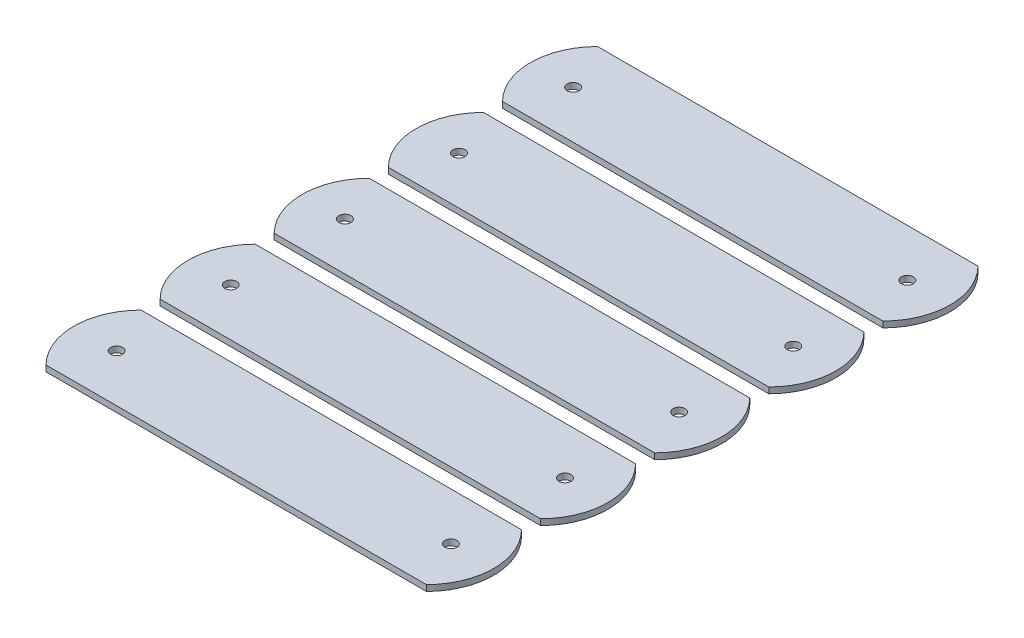
ISO-10303-21;
HEADER;
FILE_DESCRIPTION(('STEP AP214'),'2;1');
FILE_NAME('part.step','',(''),(''),'','','');
FILE_SCHEMA(('AUTOMOTIVE_DESIGN { 1 0 10303 214 1 1 1 1 }'));
ENDSEC;
DATA;
#1=APPLICATION_CONTEXT('core data for automotive mechanical design processes');
#2=APPLICATION_PROTOCOL_DEFINITION('international standard','automotive_design',2000,#1);
#3=PRODUCT_CONTEXT('',#1,'mechanical');
#4=PRODUCT('Part','Part','',(#3));
#5=PRODUCT_RELATED_PRODUCT_CATEGORY('part','',(#4));
#6=PRODUCT_DEFINITION_FORMATION('','',#4);
#7=PRODUCT_DEFINITION_CONTEXT('part definition',#1,'design');
#8=PRODUCT_DEFINITION('design','',#6,#7);
#9=PRODUCT_DEFINITION_SHAPE('','',#8);
#10=(LENGTH_UNIT() NAMED_UNIT(*) SI_UNIT(.MILLI.,.METRE.));
#11=(NAMED_UNIT(*) PLANE_ANGLE_UNIT() SI_UNIT($,.RADIAN.));
#12=(NAMED_UNIT(*) SI_UNIT($,.STERADIAN.) SOLID_ANGLE_UNIT());
#13=UNCERTAINTY_MEASURE_WITH_UNIT(LENGTH_MEASURE(1.E-05),#10,'distance_accuracy_value','');
#14=(GEOMETRIC_REPRESENTATION_CONTEXT(3) GLOBAL_UNCERTAINTY_ASSIGNED_CONTEXT((#13)) GLOBAL_UNIT_ASSIGNED_CONTEXT((#10,
#11,#12)) REPRESENTATION_CONTEXT('',''));
#15=CARTESIAN_POINT('',(0.,0.,0.));
#16=DIRECTION('',(0.,0.,1.));
#17=DIRECTION('',(1.,0.,0.));
#18=AXIS2_PLACEMENT_3D('',#15,#16,#17);
#19=CARTESIAN_POINT('',(0.,0.79375,-109.22));
#20=DIRECTION('',(0.,0.,-1.));
#21=DIRECTION('',(-1.,0.,0.));
#22=AXIS2_PLACEMENT_3D('',#19,#20,#21);
#23=PLANE('',#22);
#24=DIRECTION('',(1.,0.,0.));
#25=VECTOR('',#24,1.);
#26=CARTESIAN_POINT('',(0.,-0.79375,-109.22));
#27=LINE('',#26,#25);
#28=CARTESIAN_POINT('',(-50.8,-0.79375,-109.22));
#29=VERTEX_POINT('',#28);
#30=CARTESIAN_POINT('',(50.8,-0.79375,-109.22));
#31=VERTEX_POINT('',#30);
#32=EDGE_CURVE('E114',#29,#31,#27,.T.);
#33=ORIENTED_EDGE('',*,*,#32,.T.);
#34=DIRECTION('',(0.,-1.,0.));
#35=VECTOR('',#34,1.);
#36=CARTESIAN_POINT('',(50.8,0.79375,-109.22));
#37=LINE('',#36,#35);
#38=CARTESIAN_POINT('',(50.8,0.79375,-109.22));
#39=VERTEX_POINT('',#38);
#40=EDGE_CURVE('E12',#39,#31,#37,.T.);
#41=ORIENTED_EDGE('',*,*,#40,.F.);
#42=DIRECTION('',(1.,0.,0.));
#43=VECTOR('',#42,1.);
#44=CARTESIAN_POINT('',(0.,0.79375,-109.22));
#45=LINE('',#44,#43);
#46=CARTESIAN_POINT('',(-50.8,0.79375,-109.22));
#47=VERTEX_POINT('',#46);
#48=EDGE_CURVE('E84',#47,#39,#45,.T.);
#49=ORIENTED_EDGE('',*,*,#48,.F.);
#50=DIRECTION('',(0.,-1.,0.));
#51=VECTOR('',#50,1.);
#52=CARTESIAN_POINT('',(-50.8,0.79375,-109.22));
#53=LINE('',#52,#51);
#54=EDGE_CURVE('E60',#47,#29,#53,.T.);
#55=ORIENTED_EDGE('',*,*,#54,.T.);
#56=EDGE_LOOP('',(#33,#41,#49,#55));
#57=FACE_BOUND('',#56,.T.);
#58=ADVANCED_FACE('F44',(#57),#23,.F.);
#59=CARTESIAN_POINT('',(38.1,0.79375,-121.92));
#60=DIRECTION('',(0.,-1.,0.));
#61=DIRECTION('',(0.,0.,-1.));
#62=AXIS2_PLACEMENT_3D('',#59,#60,#61);
#63=CYLINDRICAL_SURFACE('',#62,17.9605122421383);
#64=CARTESIAN_POINT('',(38.1,-0.79375,-121.92));
#65=DIRECTION('',(0.,1.,0.));
#66=DIRECTION('',(0.,0.,1.));
#67=AXIS2_PLACEMENT_3D('',#64,#65,#66);
#68=CIRCLE('',#67,17.9605122421383);
#69=CARTESIAN_POINT('',(50.8,-0.79375,-134.62));
#70=VERTEX_POINT('',#69);
#71=EDGE_CURVE('E93',#70,#31,#68,.F.);
#72=ORIENTED_EDGE('',*,*,#71,.F.);
#73=DIRECTION('',(0.,-1.,0.));
#74=VECTOR('',#73,1.);
#75=CARTESIAN_POINT('',(50.8,0.79375,-134.62));
#76=LINE('',#75,#74);
#77=CARTESIAN_POINT('',(50.8,0.79375,-134.62));
#78=VERTEX_POINT('',#77);
#79=EDGE_CURVE('E52',#78,#70,#76,.T.);
#80=ORIENTED_EDGE('',*,*,#79,.F.);
#81=CARTESIAN_POINT('',(38.1,0.79375,-121.92));
#82=DIRECTION('',(0.,1.,0.));
#83=DIRECTION('',(0.,0.,1.));
#84=AXIS2_PLACEMENT_3D('',#81,#82,#83);
#85=CIRCLE('',#84,17.9605122421383);
#86=EDGE_CURVE('E91',#78,#39,#85,.F.);
#87=ORIENTED_EDGE('',*,*,#86,.T.);
#88=ORIENTED_EDGE('',*,*,#40,.T.);
#89=EDGE_LOOP('',(#72,#80,#87,#88));
#90=FACE_BOUND('',#89,.T.);
#91=ADVANCED_FACE('F90',(#90),#63,.T.);
#92=CARTESIAN_POINT('',(0.,0.79375,-134.62));
#93=DIRECTION('',(0.,0.,-1.));
#94=DIRECTION('',(-1.,0.,0.));
#95=AXIS2_PLACEMENT_3D('',#92,#93,#94);
#96=PLANE('',#95);
#97=DIRECTION('',(1.,0.,0.));
#98=VECTOR('',#97,1.);
#99=CARTESIAN_POINT('',(0.,-0.79375,-134.62));
#100=LINE('',#99,#98);
#101=CARTESIAN_POINT('',(-50.8,-0.79375,-134.62));
#102=VERTEX_POINT('',#101);
#103=EDGE_CURVE('E117',#102,#70,#100,.T.);
#104=ORIENTED_EDGE('',*,*,#103,.F.);
#105=DIRECTION('',(0.,-1.,0.));
#106=VECTOR('',#105,1.);
#107=CARTESIAN_POINT('',(-50.8,0.79375,-134.62));
#108=LINE('',#107,#106);
#109=CARTESIAN_POINT('',(-50.8,0.79375,-134.62));
#110=VERTEX_POINT('',#109);
#111=EDGE_CURVE('E73',#110,#102,#108,.T.);
#112=ORIENTED_EDGE('',*,*,#111,.F.);
#113=DIRECTION('',(1.,0.,0.));
#114=VECTOR('',#113,1.);
#115=CARTESIAN_POINT('',(0.,0.79375,-134.62));
#116=LINE('',#115,#114);
#117=EDGE_CURVE('E100',#110,#78,#116,.T.);
#118=ORIENTED_EDGE('',*,*,#117,.T.);
#119=ORIENTED_EDGE('',*,*,#79,.T.);
#120=EDGE_LOOP('',(#104,#112,#118,#119));
#121=FACE_BOUND('',#120,.T.);
#122=ADVANCED_FACE('F102',(#121),#96,.T.);
#123=CARTESIAN_POINT('',(-44.637105685512,0.79375,-121.92));
#124=DIRECTION('',(0.,-1.,0.));
#125=DIRECTION('',(0.,0.,-1.));
#126=AXIS2_PLACEMENT_3D('',#123,#124,#125);
#127=CYLINDRICAL_SURFACE('',#126,1.6002);
#128=CARTESIAN_POINT('',(-44.637105685512,0.79375,-121.92));
#129=DIRECTION('',(0.,1.,0.));
#130=DIRECTION('',(0.,0.,1.));
#131=AXIS2_PLACEMENT_3D('',#128,#129,#130);
#132=CIRCLE('',#131,1.6002);
#133=CARTESIAN_POINT('',(-44.637105685512,0.79375,-120.3198));
#134=VERTEX_POINT('',#133);
#135=EDGE_CURVE('E105',#134,#134,#132,.T.);
#136=ORIENTED_EDGE('',*,*,#135,.T.);
#137=EDGE_LOOP('',(#136));
#138=FACE_BOUND('',#137,.T.);
#139=CARTESIAN_POINT('',(-44.637105685512,-0.79375,-121.92));
#140=DIRECTION('',(0.,1.,0.));
#141=DIRECTION('',(0.,0.,1.));
#142=AXIS2_PLACEMENT_3D('',#139,#140,#141);
#143=CIRCLE('',#142,1.6002);
#144=CARTESIAN_POINT('',(-44.637105685512,-0.79375,-120.3198));
#145=VERTEX_POINT('',#144);
#146=EDGE_CURVE('E122',#145,#145,#143,.T.);
#147=ORIENTED_EDGE('',*,*,#146,.F.);
#148=EDGE_LOOP('',(#147));
#149=FACE_BOUND('',#148,.T.);
#150=ADVANCED_FACE('F149',(#138,#149),#127,.F.);
#151=CARTESIAN_POINT('',(-38.1,0.79375,-121.92));
#152=DIRECTION('',(0.,-1.,0.));
#153=DIRECTION('',(0.,0.,-1.));
#154=AXIS2_PLACEMENT_3D('',#151,#152,#153);
#155=CYLINDRICAL_SURFACE('',#154,17.9605122421383);
#156=CARTESIAN_POINT('',(-38.1,-0.79375,-121.92));
#157=DIRECTION('',(0.,1.,0.));
#158=DIRECTION('',(0.,0.,1.));
#159=AXIS2_PLACEMENT_3D('',#156,#157,#158);
#160=CIRCLE('',#159,17.9605122421383);
#161=EDGE_CURVE('E119',#29,#102,#160,.F.);
#162=ORIENTED_EDGE('',*,*,#161,.F.);
#163=ORIENTED_EDGE('',*,*,#54,.F.);
#164=CARTESIAN_POINT('',(-38.1,0.79375,-121.92));
#165=DIRECTION('',(0.,1.,0.));
#166=DIRECTION('',(0.,0.,1.));
#167=AXIS2_PLACEMENT_3D('',#164,#165,#166);
#168=CIRCLE('',#167,17.9605122421383);
#169=EDGE_CURVE('E103',#47,#110,#168,.F.);
#170=ORIENTED_EDGE('',*,*,#169,.T.);
#171=ORIENTED_EDGE('',*,*,#111,.T.);
#172=EDGE_LOOP('',(#162,#163,#170,#171));
#173=FACE_BOUND('',#172,.T.);
#174=ADVANCED_FACE('F147',(#173),#155,.T.);
#175=CARTESIAN_POINT('',(44.6371056855121,0.79375,-121.92));
#176=DIRECTION('',(0.,-1.,0.));
#177=DIRECTION('',(0.,0.,-1.));
#178=AXIS2_PLACEMENT_3D('',#175,#176,#177);
#179=CYLINDRICAL_SURFACE('',#178,1.6002);
#180=CARTESIAN_POINT('',(44.6371056855121,0.79375,-121.92));
#181=DIRECTION('',(0.,1.,0.));
#182=DIRECTION('',(0.,0.,1.));
#183=AXIS2_PLACEMENT_3D('',#180,#181,#182);
#184=CIRCLE('',#183,1.6002);
#185=CARTESIAN_POINT('',(44.6371056855121,0.79375,-120.3198));
#186=VERTEX_POINT('',#185);
#187=EDGE_CURVE('E111',#186,#186,#184,.F.);
#188=ORIENTED_EDGE('',*,*,#187,.F.);
#189=EDGE_LOOP('',(#188));
#190=FACE_BOUND('',#189,.T.);
#191=CARTESIAN_POINT('',(44.6371056855121,-0.79375,-121.92));
#192=DIRECTION('',(0.,1.,0.));
#193=DIRECTION('',(0.,0.,1.));
#194=AXIS2_PLACEMENT_3D('',#191,#192,#193);
#195=CIRCLE('',#194,1.6002);
#196=CARTESIAN_POINT('',(44.6371056855121,-0.79375,-120.3198));
#197=VERTEX_POINT('',#196);
#198=EDGE_CURVE('E125',#197,#197,#195,.F.);
#199=ORIENTED_EDGE('',*,*,#198,.T.);
#200=EDGE_LOOP('',(#199));
#201=FACE_BOUND('',#200,.T.);
#202=ADVANCED_FACE('F131',(#190,#201),#179,.F.);
#203=CARTESIAN_POINT('',(0.,0.79375,-121.92));
#204=DIRECTION('',(0.,1.,0.));
#205=DIRECTION('',(0.,0.,1.));
#206=AXIS2_PLACEMENT_3D('',#203,#204,#205);
#207=PLANE('',#206);
#208=ORIENTED_EDGE('',*,*,#48,.T.);
#209=ORIENTED_EDGE('',*,*,#86,.F.);
#210=ORIENTED_EDGE('',*,*,#117,.F.);
#211=ORIENTED_EDGE('',*,*,#169,.F.);
#212=EDGE_LOOP('',(#208,#209,#210,#211));
#213=FACE_BOUND('',#212,.T.);
#214=ORIENTED_EDGE('',*,*,#135,.F.);
#215=EDGE_LOOP('',(#214));
#216=FACE_BOUND('',#215,.T.);
#217=ORIENTED_EDGE('',*,*,#187,.T.);
#218=EDGE_LOOP('',(#217));
#219=FACE_BOUND('',#218,.T.);
#220=ADVANCED_FACE('F98',(#213,#216,#219),#207,.T.);
#221=CARTESIAN_POINT('',(0.,-0.79375,-121.92));
#222=DIRECTION('',(0.,1.,0.));
#223=DIRECTION('',(0.,0.,1.));
#224=AXIS2_PLACEMENT_3D('',#221,#222,#223);
#225=PLANE('',#224);
#226=ORIENTED_EDGE('',*,*,#32,.F.);
#227=ORIENTED_EDGE('',*,*,#161,.T.);
#228=ORIENTED_EDGE('',*,*,#103,.T.);
#229=ORIENTED_EDGE('',*,*,#71,.T.);
#230=EDGE_LOOP('',(#226,#227,#228,#229));
#231=FACE_BOUND('',#230,.T.);
#232=ORIENTED_EDGE('',*,*,#146,.T.);
#233=EDGE_LOOP('',(#232));
#234=FACE_BOUND('',#233,.T.);
#235=ORIENTED_EDGE('',*,*,#198,.F.);
#236=EDGE_LOOP('',(#235));
#237=FACE_BOUND('',#236,.T.);
#238=ADVANCED_FACE('F133',(#231,#234,#237),#225,.F.);
#239=CLOSED_SHELL('',(#58,#91,#122,#150,#174,#202,#220,#238));
#240=MANIFOLD_SOLID_BREP('B2',#239);
#241=CARTESIAN_POINT('',(0.,0.79375,-78.74));
#242=DIRECTION('',(0.,0.,-1.));
#243=DIRECTION('',(-1.,0.,0.));
#244=AXIS2_PLACEMENT_3D('',#241,#242,#243);
#245=PLANE('',#244);
#246=DIRECTION('',(1.,0.,0.));
#247=VECTOR('',#246,1.);
#248=CARTESIAN_POINT('',(0.,-0.79375,-78.74));
#249=LINE('',#248,#247);
#250=CARTESIAN_POINT('',(-50.8,-0.79375,-78.74));
#251=VERTEX_POINT('',#250);
#252=CARTESIAN_POINT('',(50.8,-0.79375,-78.74));
#253=VERTEX_POINT('',#252);
#254=EDGE_CURVE('E302',#251,#253,#249,.T.);
#255=ORIENTED_EDGE('',*,*,#254,.T.);
#256=DIRECTION('',(0.,-1.,0.));
#257=VECTOR('',#256,1.);
#258=CARTESIAN_POINT('',(50.8,0.79375,-78.74));
#259=LINE('',#258,#257);
#260=CARTESIAN_POINT('',(50.8,0.79375,-78.74));
#261=VERTEX_POINT('',#260);
#262=EDGE_CURVE('E42',#261,#253,#259,.T.);
#263=ORIENTED_EDGE('',*,*,#262,.F.);
#264=DIRECTION('',(1.,0.,0.));
#265=VECTOR('',#264,1.);
#266=CARTESIAN_POINT('',(0.,0.79375,-78.74));
#267=LINE('',#266,#265);
#268=CARTESIAN_POINT('',(-50.8,0.79375,-78.74));
#269=VERTEX_POINT('',#268);
#270=EDGE_CURVE('E272',#269,#261,#267,.T.);
#271=ORIENTED_EDGE('',*,*,#270,.F.);
#272=DIRECTION('',(0.,-1.,0.));
#273=VECTOR('',#272,1.);
#274=CARTESIAN_POINT('',(-50.8,0.79375,-78.74));
#275=LINE('',#274,#273);
#276=EDGE_CURVE('E248',#269,#251,#275,.T.);
#277=ORIENTED_EDGE('',*,*,#276,.T.);
#278=EDGE_LOOP('',(#255,#263,#271,#277));
#279=FACE_BOUND('',#278,.T.);
#280=ADVANCED_FACE('F232',(#279),#245,.F.);
#281=CARTESIAN_POINT('',(38.1,0.79375,-91.44));
#282=DIRECTION('',(0.,-1.,0.));
#283=DIRECTION('',(0.,0.,-1.));
#284=AXIS2_PLACEMENT_3D('',#281,#282,#283);
#285=CYLINDRICAL_SURFACE('',#284,17.9605122421383);
#286=CARTESIAN_POINT('',(38.1,-0.79375,-91.44));
#287=DIRECTION('',(0.,1.,0.));
#288=DIRECTION('',(0.,0.,1.));
#289=AXIS2_PLACEMENT_3D('',#286,#287,#288);
#290=CIRCLE('',#289,17.9605122421383);
#291=CARTESIAN_POINT('',(50.8,-0.79375,-104.14));
#292=VERTEX_POINT('',#291);
#293=EDGE_CURVE('E281',#292,#253,#290,.F.);
#294=ORIENTED_EDGE('',*,*,#293,.F.);
#295=DIRECTION('',(0.,-1.,0.));
#296=VECTOR('',#295,1.);
#297=CARTESIAN_POINT('',(50.8,0.79375,-104.14));
#298=LINE('',#297,#296);
#299=CARTESIAN_POINT('',(50.8,0.79375,-104.14));
#300=VERTEX_POINT('',#299);
#301=EDGE_CURVE('E240',#300,#292,#298,.T.);
#302=ORIENTED_EDGE('',*,*,#301,.F.);
#303=CARTESIAN_POINT('',(38.1,0.79375,-91.44));
#304=DIRECTION('',(0.,1.,0.));
#305=DIRECTION('',(0.,0.,1.));
#306=AXIS2_PLACEMENT_3D('',#303,#304,#305);
#307=CIRCLE('',#306,17.9605122421383);
#308=EDGE_CURVE('E279',#300,#261,#307,.F.);
#309=ORIENTED_EDGE('',*,*,#308,.T.);
#310=ORIENTED_EDGE('',*,*,#262,.T.);
#311=EDGE_LOOP('',(#294,#302,#309,#310));
#312=FACE_BOUND('',#311,.T.);
#313=ADVANCED_FACE('F278',(#312),#285,.T.);
#314=CARTESIAN_POINT('',(0.,0.79375,-104.14));
#315=DIRECTION('',(0.,0.,-1.));
#316=DIRECTION('',(-1.,0.,0.));
#317=AXIS2_PLACEMENT_3D('',#314,#315,#316);
#318=PLANE('',#317);
#319=DIRECTION('',(1.,0.,0.));
#320=VECTOR('',#319,1.);
#321=CARTESIAN_POINT('',(0.,-0.79375,-104.14));
#322=LINE('',#321,#320);
#323=CARTESIAN_POINT('',(-50.8,-0.79375,-104.14));
#324=VERTEX_POINT('',#323);
#325=EDGE_CURVE('E305',#324,#292,#322,.T.);
#326=ORIENTED_EDGE('',*,*,#325,.F.);
#327=DIRECTION('',(0.,-1.,0.));
#328=VECTOR('',#327,1.);
#329=CARTESIAN_POINT('',(-50.8,0.79375,-104.14));
#330=LINE('',#329,#328);
#331=CARTESIAN_POINT('',(-50.8,0.79375,-104.14));
#332=VERTEX_POINT('',#331);
#333=EDGE_CURVE('E261',#332,#324,#330,.T.);
#334=ORIENTED_EDGE('',*,*,#333,.F.);
#335=DIRECTION('',(1.,0.,0.));
#336=VECTOR('',#335,1.);
#337=CARTESIAN_POINT('',(0.,0.79375,-104.14));
#338=LINE('',#337,#336);
#339=EDGE_CURVE('E288',#332,#300,#338,.T.);
#340=ORIENTED_EDGE('',*,*,#339,.T.);
#341=ORIENTED_EDGE('',*,*,#301,.T.);
#342=EDGE_LOOP('',(#326,#334,#340,#341));
#343=FACE_BOUND('',#342,.T.);
#344=ADVANCED_FACE('F290',(#343),#318,.T.);
#345=CARTESIAN_POINT('',(-44.637105685512,0.79375,-91.44));
#346=DIRECTION('',(0.,-1.,0.));
#347=DIRECTION('',(0.,0.,-1.));
#348=AXIS2_PLACEMENT_3D('',#345,#346,#347);
#349=CYLINDRICAL_SURFACE('',#348,1.6002);
#350=CARTESIAN_POINT('',(-44.637105685512,0.79375,-91.44));
#351=DIRECTION('',(0.,1.,0.));
#352=DIRECTION('',(0.,0.,1.));
#353=AXIS2_PLACEMENT_3D('',#350,#351,#352);
#354=CIRCLE('',#353,1.6002);
#355=CARTESIAN_POINT('',(-44.637105685512,0.79375,-89.8398));
#356=VERTEX_POINT('',#355);
#357=EDGE_CURVE('E293',#356,#356,#354,.T.);
#358=ORIENTED_EDGE('',*,*,#357,.T.);
#359=EDGE_LOOP('',(#358));
#360=FACE_BOUND('',#359,.T.);
#361=CARTESIAN_POINT('',(-44.637105685512,-0.79375,-91.44));
#362=DIRECTION('',(0.,1.,0.));
#363=DIRECTION('',(0.,0.,1.));
#364=AXIS2_PLACEMENT_3D('',#361,#362,#363);
#365=CIRCLE('',#364,1.6002);
#366=CARTESIAN_POINT('',(-44.637105685512,-0.79375,-89.8398));
#367=VERTEX_POINT('',#366);
#368=EDGE_CURVE('E310',#367,#367,#365,.T.);
#369=ORIENTED_EDGE('',*,*,#368,.F.);
#370=EDGE_LOOP('',(#369));
#371=FACE_BOUND('',#370,.T.);
#372=ADVANCED_FACE('F337',(#360,#371),#349,.F.);
#373=CARTESIAN_POINT('',(-38.1,0.79375,-91.44));
#374=DIRECTION('',(0.,-1.,0.));
#375=DIRECTION('',(0.,0.,-1.));
#376=AXIS2_PLACEMENT_3D('',#373,#374,#375);
#377=CYLINDRICAL_SURFACE('',#376,17.9605122421383);
#378=CARTESIAN_POINT('',(-38.1,-0.79375,-91.44));
#379=DIRECTION('',(0.,1.,0.));
#380=DIRECTION('',(0.,0.,1.));
#381=AXIS2_PLACEMENT_3D('',#378,#379,#380);
#382=CIRCLE('',#381,17.9605122421383);
#383=EDGE_CURVE('E307',#251,#324,#382,.F.);
#384=ORIENTED_EDGE('',*,*,#383,.F.);
#385=ORIENTED_EDGE('',*,*,#276,.F.);
#386=CARTESIAN_POINT('',(-38.1,0.79375,-91.44));
#387=DIRECTION('',(0.,1.,0.));
#388=DIRECTION('',(0.,0.,1.));
#389=AXIS2_PLACEMENT_3D('',#386,#387,#388);
#390=CIRCLE('',#389,17.9605122421383);
#391=EDGE_CURVE('E291',#269,#332,#390,.F.);
#392=ORIENTED_EDGE('',*,*,#391,.T.);
#393=ORIENTED_EDGE('',*,*,#333,.T.);
#394=EDGE_LOOP('',(#384,#385,#392,#393));
#395=FACE_BOUND('',#394,.T.);
#396=ADVANCED_FACE('F335',(#395),#377,.T.);
#397=CARTESIAN_POINT('',(44.6371056855121,0.79375,-91.44));
#398=DIRECTION('',(0.,-1.,0.));
#399=DIRECTION('',(0.,0.,-1.));
#400=AXIS2_PLACEMENT_3D('',#397,#398,#399);
#401=CYLINDRICAL_SURFACE('',#400,1.6002);
#402=CARTESIAN_POINT('',(44.6371056855121,0.79375,-91.44));
#403=DIRECTION('',(0.,1.,0.));
#404=DIRECTION('',(0.,0.,1.));
#405=AXIS2_PLACEMENT_3D('',#402,#403,#404);
#406=CIRCLE('',#405,1.6002);
#407=CARTESIAN_POINT('',(44.6371056855121,0.79375,-89.8398));
#408=VERTEX_POINT('',#407);
#409=EDGE_CURVE('E299',#408,#408,#406,.F.);
#410=ORIENTED_EDGE('',*,*,#409,.F.);
#411=EDGE_LOOP('',(#410));
#412=FACE_BOUND('',#411,.T.);
#413=CARTESIAN_POINT('',(44.6371056855121,-0.79375,-91.44));
#414=DIRECTION('',(0.,1.,0.));
#415=DIRECTION('',(0.,0.,1.));
#416=AXIS2_PLACEMENT_3D('',#413,#414,#415);
#417=CIRCLE('',#416,1.6002);
#418=CARTESIAN_POINT('',(44.6371056855121,-0.79375,-89.8398));
#419=VERTEX_POINT('',#418);
#420=EDGE_CURVE('E313',#419,#419,#417,.F.);
#421=ORIENTED_EDGE('',*,*,#420,.T.);
#422=EDGE_LOOP('',(#421));
#423=FACE_BOUND('',#422,.T.);
#424=ADVANCED_FACE('F319',(#412,#423),#401,.F.);
#425=CARTESIAN_POINT('',(0.,0.79375,-91.44));
#426=DIRECTION('',(0.,1.,0.));
#427=DIRECTION('',(0.,0.,1.));
#428=AXIS2_PLACEMENT_3D('',#425,#426,#427);
#429=PLANE('',#428);
#430=ORIENTED_EDGE('',*,*,#270,.T.);
#431=ORIENTED_EDGE('',*,*,#308,.F.);
#432=ORIENTED_EDGE('',*,*,#339,.F.);
#433=ORIENTED_EDGE('',*,*,#391,.F.);
#434=EDGE_LOOP('',(#430,#431,#432,#433));
#435=FACE_BOUND('',#434,.T.);
#436=ORIENTED_EDGE('',*,*,#357,.F.);
#437=EDGE_LOOP('',(#436));
#438=FACE_BOUND('',#437,.T.);
#439=ORIENTED_EDGE('',*,*,#409,.T.);
#440=EDGE_LOOP('',(#439));
#441=FACE_BOUND('',#440,.T.);
#442=ADVANCED_FACE('F286',(#435,#438,#441),#429,.T.);
#443=CARTESIAN_POINT('',(0.,-0.79375,-91.44));
#444=DIRECTION('',(0.,1.,0.));
#445=DIRECTION('',(0.,0.,1.));
#446=AXIS2_PLACEMENT_3D('',#443,#444,#445);
#447=PLANE('',#446);
#448=ORIENTED_EDGE('',*,*,#254,.F.);
#449=ORIENTED_EDGE('',*,*,#383,.T.);
#450=ORIENTED_EDGE('',*,*,#325,.T.);
#451=ORIENTED_EDGE('',*,*,#293,.T.);
#452=EDGE_LOOP('',(#448,#449,#450,#451));
#453=FACE_BOUND('',#452,.T.);
#454=ORIENTED_EDGE('',*,*,#368,.T.);
#455=EDGE_LOOP('',(#454));
#456=FACE_BOUND('',#455,.T.);
#457=ORIENTED_EDGE('',*,*,#420,.F.);
#458=EDGE_LOOP('',(#457));
#459=FACE_BOUND('',#458,.T.);
#460=ADVANCED_FACE('F321',(#453,#456,#459),#447,.F.);
#461=CLOSED_SHELL('',(#280,#313,#344,#372,#396,#424,#442,#460));
#462=MANIFOLD_SOLID_BREP('B6',#461);
#463=CARTESIAN_POINT('',(0.,0.79375,-48.26));
#464=DIRECTION('',(0.,0.,-1.));
#465=DIRECTION('',(-1.,0.,0.));
#466=AXIS2_PLACEMENT_3D('',#463,#464,#465);
#467=PLANE('',#466);
#468=DIRECTION('',(1.,0.,0.));
#469=VECTOR('',#468,1.);
#470=CARTESIAN_POINT('',(0.,-0.79375,-48.26));
#471=LINE('',#470,#469);
#472=CARTESIAN_POINT('',(-50.8,-0.79375,-48.26));
#473=VERTEX_POINT('',#472);
#474=CARTESIAN_POINT('',(50.8,-0.79375,-48.26));
#475=VERTEX_POINT('',#474);
#476=EDGE_CURVE('E490',#473,#475,#471,.T.);
#477=ORIENTED_EDGE('',*,*,#476,.T.);
#478=DIRECTION('',(0.,-1.,0.));
#479=VECTOR('',#478,1.);
#480=CARTESIAN_POINT('',(50.8,0.79375,-48.26));
#481=LINE('',#480,#479);
#482=CARTESIAN_POINT('',(50.8,0.79375,-48.26));
#483=VERTEX_POINT('',#482);
#484=EDGE_CURVE('E230',#483,#475,#481,.T.);
#485=ORIENTED_EDGE('',*,*,#484,.F.);
#486=DIRECTION('',(1.,0.,0.));
#487=VECTOR('',#486,1.);
#488=CARTESIAN_POINT('',(0.,0.79375,-48.26));
#489=LINE('',#488,#487);
#490=CARTESIAN_POINT('',(-50.8,0.79375,-48.26));
#491=VERTEX_POINT('',#490);
#492=EDGE_CURVE('E460',#491,#483,#489,.T.);
#493=ORIENTED_EDGE('',*,*,#492,.F.);
#494=DIRECTION('',(0.,-1.,0.));
#495=VECTOR('',#494,1.);
#496=CARTESIAN_POINT('',(-50.8,0.79375,-48.26));
#497=LINE('',#496,#495);
#498=EDGE_CURVE('E436',#491,#473,#497,.T.);
#499=ORIENTED_EDGE('',*,*,#498,.T.);
#500=EDGE_LOOP('',(#477,#485,#493,#499));
#501=FACE_BOUND('',#500,.T.);
#502=ADVANCED_FACE('F420',(#501),#467,.F.);
#503=CARTESIAN_POINT('',(38.1,0.79375,-60.96));
#504=DIRECTION('',(0.,-1.,0.));
#505=DIRECTION('',(0.,0.,-1.));
#506=AXIS2_PLACEMENT_3D('',#503,#504,#505);
#507=CYLINDRICAL_SURFACE('',#506,17.9605122421383);
#508=CARTESIAN_POINT('',(38.1,-0.79375,-60.96));
#509=DIRECTION('',(0.,1.,0.));
#510=DIRECTION('',(0.,0.,1.));
#511=AXIS2_PLACEMENT_3D('',#508,#509,#510);
#512=CIRCLE('',#511,17.9605122421383);
#513=CARTESIAN_POINT('',(50.8,-0.79375,-73.66));
#514=VERTEX_POINT('',#513);
#515=EDGE_CURVE('E469',#514,#475,#512,.F.);
#516=ORIENTED_EDGE('',*,*,#515,.F.);
#517=DIRECTION('',(0.,-1.,0.));
#518=VECTOR('',#517,1.);
#519=CARTESIAN_POINT('',(50.8,0.79375,-73.66));
#520=LINE('',#519,#518);
#521=CARTESIAN_POINT('',(50.8,0.79375,-73.66));
#522=VERTEX_POINT('',#521);
#523=EDGE_CURVE('E428',#522,#514,#520,.T.);
#524=ORIENTED_EDGE('',*,*,#523,.F.);
#525=CARTESIAN_POINT('',(38.1,0.79375,-60.96));
#526=DIRECTION('',(0.,1.,0.));
#527=DIRECTION('',(0.,0.,1.));
#528=AXIS2_PLACEMENT_3D('',#525,#526,#527);
#529=CIRCLE('',#528,17.9605122421383);
#530=EDGE_CURVE('E467',#522,#483,#529,.F.);
#531=ORIENTED_EDGE('',*,*,#530,.T.);
#532=ORIENTED_EDGE('',*,*,#484,.T.);
#533=EDGE_LOOP('',(#516,#524,#531,#532));
#534=FACE_BOUND('',#533,.T.);
#535=ADVANCED_FACE('F466',(#534),#507,.T.);
#536=CARTESIAN_POINT('',(0.,0.79375,-73.66));
#537=DIRECTION('',(0.,0.,-1.));
#538=DIRECTION('',(-1.,0.,0.));
#539=AXIS2_PLACEMENT_3D('',#536,#537,#538);
#540=PLANE('',#539);
#541=DIRECTION('',(1.,0.,0.));
#542=VECTOR('',#541,1.);
#543=CARTESIAN_POINT('',(0.,-0.79375,-73.66));
#544=LINE('',#543,#542);
#545=CARTESIAN_POINT('',(-50.8,-0.79375,-73.66));
#546=VERTEX_POINT('',#545);
#547=EDGE_CURVE('E493',#546,#514,#544,.T.);
#548=ORIENTED_EDGE('',*,*,#547,.F.);
#549=DIRECTION('',(0.,-1.,0.));
#550=VECTOR('',#549,1.);
#551=CARTESIAN_POINT('',(-50.8,0.79375,-73.66));
#552=LINE('',#551,#550);
#553=CARTESIAN_POINT('',(-50.8,0.79375,-73.66));
#554=VERTEX_POINT('',#553);
#555=EDGE_CURVE('E449',#554,#546,#552,.T.);
#556=ORIENTED_EDGE('',*,*,#555,.F.);
#557=DIRECTION('',(1.,0.,0.));
#558=VECTOR('',#557,1.);
#559=CARTESIAN_POINT('',(0.,0.79375,-73.66));
#560=LINE('',#559,#558);
#561=EDGE_CURVE('E476',#554,#522,#560,.T.);
#562=ORIENTED_EDGE('',*,*,#561,.T.);
#563=ORIENTED_EDGE('',*,*,#523,.T.);
#564=EDGE_LOOP('',(#548,#556,#562,#563));
#565=FACE_BOUND('',#564,.T.);
#566=ADVANCED_FACE('F478',(#565),#540,.T.);
#567=CARTESIAN_POINT('',(-44.637105685512,0.79375,-60.96));
#568=DIRECTION('',(0.,-1.,0.));
#569=DIRECTION('',(0.,0.,-1.));
#570=AXIS2_PLACEMENT_3D('',#567,#568,#569);
#571=CYLINDRICAL_SURFACE('',#570,1.6002);
#572=CARTESIAN_POINT('',(-44.637105685512,0.79375,-60.96));
#573=DIRECTION('',(0.,1.,0.));
#574=DIRECTION('',(0.,0.,1.));
#575=AXIS2_PLACEMENT_3D('',#572,#573,#574);
#576=CIRCLE('',#575,1.6002);
#577=CARTESIAN_POINT('',(-44.637105685512,0.79375,-59.3598));
#578=VERTEX_POINT('',#577);
#579=EDGE_CURVE('E481',#578,#578,#576,.T.);
#580=ORIENTED_EDGE('',*,*,#579,.T.);
#581=EDGE_LOOP('',(#580));
#582=FACE_BOUND('',#581,.T.);
#583=CARTESIAN_POINT('',(-44.637105685512,-0.79375,-60.96));
#584=DIRECTION('',(0.,1.,0.));
#585=DIRECTION('',(0.,0.,1.));
#586=AXIS2_PLACEMENT_3D('',#583,#584,#585);
#587=CIRCLE('',#586,1.6002);
#588=CARTESIAN_POINT('',(-44.637105685512,-0.79375,-59.3598));
#589=VERTEX_POINT('',#588);
#590=EDGE_CURVE('E498',#589,#589,#587,.T.);
#591=ORIENTED_EDGE('',*,*,#590,.F.);
#592=EDGE_LOOP('',(#591));
#593=FACE_BOUND('',#592,.T.);
#594=ADVANCED_FACE('F525',(#582,#593),#571,.F.);
#595=CARTESIAN_POINT('',(-38.1,0.79375,-60.96));
#596=DIRECTION('',(0.,-1.,0.));
#597=DIRECTION('',(0.,0.,-1.));
#598=AXIS2_PLACEMENT_3D('',#595,#596,#597);
#599=CYLINDRICAL_SURFACE('',#598,17.9605122421383);
#600=CARTESIAN_POINT('',(-38.1,-0.79375,-60.96));
#601=DIRECTION('',(0.,1.,0.));
#602=DIRECTION('',(0.,0.,1.));
#603=AXIS2_PLACEMENT_3D('',#600,#601,#602);
#604=CIRCLE('',#603,17.9605122421383);
#605=EDGE_CURVE('E495',#473,#546,#604,.F.);
#606=ORIENTED_EDGE('',*,*,#605,.F.);
#607=ORIENTED_EDGE('',*,*,#498,.F.);
#608=CARTESIAN_POINT('',(-38.1,0.79375,-60.96));
#609=DIRECTION('',(0.,1.,0.));
#610=DIRECTION('',(0.,0.,1.));
#611=AXIS2_PLACEMENT_3D('',#608,#609,#610);
#612=CIRCLE('',#611,17.9605122421383);
#613=EDGE_CURVE('E479',#491,#554,#612,.F.);
#614=ORIENTED_EDGE('',*,*,#613,.T.);
#615=ORIENTED_EDGE('',*,*,#555,.T.);
#616=EDGE_LOOP('',(#606,#607,#614,#615));
#617=FACE_BOUND('',#616,.T.);
#618=ADVANCED_FACE('F523',(#617),#599,.T.);
#619=CARTESIAN_POINT('',(44.6371056855121,0.79375,-60.96));
#620=DIRECTION('',(0.,-1.,0.));
#621=DIRECTION('',(0.,0.,-1.));
#622=AXIS2_PLACEMENT_3D('',#619,#620,#621);
#623=CYLINDRICAL_SURFACE('',#622,1.6002);
#624=CARTESIAN_POINT('',(44.6371056855121,0.79375,-60.96));
#625=DIRECTION('',(0.,1.,0.));
#626=DIRECTION('',(0.,0.,1.));
#627=AXIS2_PLACEMENT_3D('',#624,#625,#626);
#628=CIRCLE('',#627,1.6002);
#629=CARTESIAN_POINT('',(44.6371056855121,0.79375,-59.3598));
#630=VERTEX_POINT('',#629);
#631=EDGE_CURVE('E487',#630,#630,#628,.F.);
#632=ORIENTED_EDGE('',*,*,#631,.F.);
#633=EDGE_LOOP('',(#632));
#634=FACE_BOUND('',#633,.T.);
#635=CARTESIAN_POINT('',(44.6371056855121,-0.79375,-60.96));
#636=DIRECTION('',(0.,1.,0.));
#637=DIRECTION('',(0.,0.,1.));
#638=AXIS2_PLACEMENT_3D('',#635,#636,#637);
#639=CIRCLE('',#638,1.6002);
#640=CARTESIAN_POINT('',(44.6371056855121,-0.79375,-59.3598));
#641=VERTEX_POINT('',#640);
#642=EDGE_CURVE('E501',#641,#641,#639,.F.);
#643=ORIENTED_EDGE('',*,*,#642,.T.);
#644=EDGE_LOOP('',(#643));
#645=FACE_BOUND('',#644,.T.);
#646=ADVANCED_FACE('F507',(#634,#645),#623,.F.);
#647=CARTESIAN_POINT('',(0.,0.79375,-60.96));
#648=DIRECTION('',(0.,1.,0.));
#649=DIRECTION('',(0.,0.,1.));
#650=AXIS2_PLACEMENT_3D('',#647,#648,#649);
#651=PLANE('',#650);
#652=ORIENTED_EDGE('',*,*,#492,.T.);
#653=ORIENTED_EDGE('',*,*,#530,.F.);
#654=ORIENTED_EDGE('',*,*,#561,.F.);
#655=ORIENTED_EDGE('',*,*,#613,.F.);
#656=EDGE_LOOP('',(#652,#653,#654,#655));
#657=FACE_BOUND('',#656,.T.);
#658=ORIENTED_EDGE('',*,*,#579,.F.);
#659=EDGE_LOOP('',(#658));
#660=FACE_BOUND('',#659,.T.);
#661=ORIENTED_EDGE('',*,*,#631,.T.);
#662=EDGE_LOOP('',(#661));
#663=FACE_BOUND('',#662,.T.);
#664=ADVANCED_FACE('F474',(#657,#660,#663),#651,.T.);
#665=CARTESIAN_POINT('',(0.,-0.79375,-60.96));
#666=DIRECTION('',(0.,1.,0.));
#667=DIRECTION('',(0.,0.,1.));
#668=AXIS2_PLACEMENT_3D('',#665,#666,#667);
#669=PLANE('',#668);
#670=ORIENTED_EDGE('',*,*,#476,.F.);
#671=ORIENTED_EDGE('',*,*,#605,.T.);
#672=ORIENTED_EDGE('',*,*,#547,.T.);
#673=ORIENTED_EDGE('',*,*,#515,.T.);
#674=EDGE_LOOP('',(#670,#671,#672,#673));
#675=FACE_BOUND('',#674,.T.);
#676=ORIENTED_EDGE('',*,*,#590,.T.);
#677=EDGE_LOOP('',(#676));
#678=FACE_BOUND('',#677,.T.);
#679=ORIENTED_EDGE('',*,*,#642,.F.);
#680=EDGE_LOOP('',(#679));
#681=FACE_BOUND('',#680,.T.);
#682=ADVANCED_FACE('F509',(#675,#678,#681),#669,.F.);
#683=CLOSED_SHELL('',(#502,#535,#566,#594,#618,#646,#664,#682));
#684=MANIFOLD_SOLID_BREP('B36',#683);
#685=CARTESIAN_POINT('',(0.,0.79375,-17.78));
#686=DIRECTION('',(0.,0.,-1.));
#687=DIRECTION('',(-1.,0.,0.));
#688=AXIS2_PLACEMENT_3D('',#685,#686,#687);
#689=PLANE('',#688);
#690=DIRECTION('',(1.,0.,0.));
#691=VECTOR('',#690,1.);
#692=CARTESIAN_POINT('',(0.,-0.79375,-17.78));
#693=LINE('',#692,#691);
#694=CARTESIAN_POINT('',(-50.8,-0.79375,-17.78));
#695=VERTEX_POINT('',#694);
#696=CARTESIAN_POINT('',(50.8,-0.79375,-17.78));
#697=VERTEX_POINT('',#696);
#698=EDGE_CURVE('E677',#695,#697,#693,.T.);
#699=ORIENTED_EDGE('',*,*,#698,.T.);
#700=DIRECTION('',(0.,-1.,0.));
#701=VECTOR('',#700,1.);
#702=CARTESIAN_POINT('',(50.8,0.79375,-17.78));
#703=LINE('',#702,#701);
#704=CARTESIAN_POINT('',(50.8,0.79375,-17.78));
#705=VERTEX_POINT('',#704);
#706=EDGE_CURVE('E418',#705,#697,#703,.T.);
#707=ORIENTED_EDGE('',*,*,#706,.F.);
#708=DIRECTION('',(1.,0.,0.));
#709=VECTOR('',#708,1.);
#710=CARTESIAN_POINT('',(0.,0.79375,-17.78));
#711=LINE('',#710,#709);
#712=CARTESIAN_POINT('',(-50.8,0.79375,-17.78));
#713=VERTEX_POINT('',#712);
#714=EDGE_CURVE('E647',#713,#705,#711,.T.);
#715=ORIENTED_EDGE('',*,*,#714,.F.);
#716=DIRECTION('',(0.,-1.,0.));
#717=VECTOR('',#716,1.);
#718=CARTESIAN_POINT('',(-50.8,0.79375,-17.78));
#719=LINE('',#718,#717);
#720=EDGE_CURVE('E623',#713,#695,#719,.T.);
#721=ORIENTED_EDGE('',*,*,#720,.T.);
#722=EDGE_LOOP('',(#699,#707,#715,#721));
#723=FACE_BOUND('',#722,.T.);
#724=ADVANCED_FACE('F607',(#723),#689,.F.);
#725=CARTESIAN_POINT('',(38.1,0.79375,-30.48));
#726=DIRECTION('',(0.,-1.,0.));
#727=DIRECTION('',(0.,0.,-1.));
#728=AXIS2_PLACEMENT_3D('',#725,#726,#727);
#729=CYLINDRICAL_SURFACE('',#728,17.9605122421383);
#730=CARTESIAN_POINT('',(38.1,-0.79375,-30.48));
#731=DIRECTION('',(0.,1.,0.));
#732=DIRECTION('',(0.,0.,1.));
#733=AXIS2_PLACEMENT_3D('',#730,#731,#732);
#734=CIRCLE('',#733,17.9605122421383);
#735=CARTESIAN_POINT('',(50.8,-0.79375,-43.18));
#736=VERTEX_POINT('',#735);
#737=EDGE_CURVE('E656',#736,#697,#734,.F.);
#738=ORIENTED_EDGE('',*,*,#737,.F.);
#739=DIRECTION('',(0.,-1.,0.));
#740=VECTOR('',#739,1.);
#741=CARTESIAN_POINT('',(50.8,0.79375,-43.18));
#742=LINE('',#741,#740);
#743=CARTESIAN_POINT('',(50.8,0.79375,-43.18));
#744=VERTEX_POINT('',#743);
#745=EDGE_CURVE('E615',#744,#736,#742,.T.);
#746=ORIENTED_EDGE('',*,*,#745,.F.);
#747=CARTESIAN_POINT('',(38.1,0.79375,-30.48));
#748=DIRECTION('',(0.,1.,0.));
#749=DIRECTION('',(0.,0.,1.));
#750=AXIS2_PLACEMENT_3D('',#747,#748,#749);
#751=CIRCLE('',#750,17.9605122421383);
#752=EDGE_CURVE('E654',#744,#705,#751,.F.);
#753=ORIENTED_EDGE('',*,*,#752,.T.);
#754=ORIENTED_EDGE('',*,*,#706,.T.);
#755=EDGE_LOOP('',(#738,#746,#753,#754));
#756=FACE_BOUND('',#755,.T.);
#757=ADVANCED_FACE('F653',(#756),#729,.T.);
#758=CARTESIAN_POINT('',(0.,0.79375,-43.18));
#759=DIRECTION('',(0.,0.,-1.));
#760=DIRECTION('',(-1.,0.,0.));
#761=AXIS2_PLACEMENT_3D('',#758,#759,#760);
#762=PLANE('',#761);
#763=DIRECTION('',(1.,0.,0.));
#764=VECTOR('',#763,1.);
#765=CARTESIAN_POINT('',(0.,-0.79375,-43.18));
#766=LINE('',#765,#764);
#767=CARTESIAN_POINT('',(-50.8,-0.79375,-43.18));
#768=VERTEX_POINT('',#767);
#769=EDGE_CURVE('E680',#768,#736,#766,.T.);
#770=ORIENTED_EDGE('',*,*,#769,.F.);
#771=DIRECTION('',(0.,-1.,0.));
#772=VECTOR('',#771,1.);
#773=CARTESIAN_POINT('',(-50.8,0.79375,-43.18));
#774=LINE('',#773,#772);
#775=CARTESIAN_POINT('',(-50.8,0.79375,-43.18));
#776=VERTEX_POINT('',#775);
#777=EDGE_CURVE('E636',#776,#768,#774,.T.);
#778=ORIENTED_EDGE('',*,*,#777,.F.);
#779=DIRECTION('',(1.,0.,0.));
#780=VECTOR('',#779,1.);
#781=CARTESIAN_POINT('',(0.,0.79375,-43.18));
#782=LINE('',#781,#780);
#783=EDGE_CURVE('E663',#776,#744,#782,.T.);
#784=ORIENTED_EDGE('',*,*,#783,.T.);
#785=ORIENTED_EDGE('',*,*,#745,.T.);
#786=EDGE_LOOP('',(#770,#778,#784,#785));
#787=FACE_BOUND('',#786,.T.);
#788=ADVANCED_FACE('F665',(#787),#762,.T.);
#789=CARTESIAN_POINT('',(-44.637105685512,0.79375,-30.48));
#790=DIRECTION('',(0.,-1.,0.));
#791=DIRECTION('',(0.,0.,-1.));
#792=AXIS2_PLACEMENT_3D('',#789,#790,#791);
#793=CYLINDRICAL_SURFACE('',#792,1.6002);
#794=CARTESIAN_POINT('',(-44.637105685512,0.79375,-30.48));
#795=DIRECTION('',(0.,1.,0.));
#796=DIRECTION('',(0.,0.,1.));
#797=AXIS2_PLACEMENT_3D('',#794,#795,#796);
#798=CIRCLE('',#797,1.6002);
#799=CARTESIAN_POINT('',(-44.637105685512,0.79375,-28.8798));
#800=VERTEX_POINT('',#799);
#801=EDGE_CURVE('E668',#800,#800,#798,.T.);
#802=ORIENTED_EDGE('',*,*,#801,.T.);
#803=EDGE_LOOP('',(#802));
#804=FACE_BOUND('',#803,.T.);
#805=CARTESIAN_POINT('',(-44.637105685512,-0.79375,-30.48));
#806=DIRECTION('',(0.,1.,0.));
#807=DIRECTION('',(0.,0.,1.));
#808=AXIS2_PLACEMENT_3D('',#805,#806,#807);
#809=CIRCLE('',#808,1.6002);
#810=CARTESIAN_POINT('',(-44.637105685512,-0.79375,-28.8798));
#811=VERTEX_POINT('',#810);
#812=EDGE_CURVE('E685',#811,#811,#809,.T.);
#813=ORIENTED_EDGE('',*,*,#812,.F.);
#814=EDGE_LOOP('',(#813));
#815=FACE_BOUND('',#814,.T.);
#816=ADVANCED_FACE('F712',(#804,#815),#793,.F.);
#817=CARTESIAN_POINT('',(-38.1,0.79375,-30.48));
#818=DIRECTION('',(0.,-1.,0.));
#819=DIRECTION('',(0.,0.,-1.));
#820=AXIS2_PLACEMENT_3D('',#817,#818,#819);
#821=CYLINDRICAL_SURFACE('',#820,17.9605122421383);
#822=CARTESIAN_POINT('',(-38.1,-0.79375,-30.48));
#823=DIRECTION('',(0.,1.,0.));
#824=DIRECTION('',(0.,0.,1.));
#825=AXIS2_PLACEMENT_3D('',#822,#823,#824);
#826=CIRCLE('',#825,17.9605122421383);
#827=EDGE_CURVE('E682',#695,#768,#826,.F.);
#828=ORIENTED_EDGE('',*,*,#827,.F.);
#829=ORIENTED_EDGE('',*,*,#720,.F.);
#830=CARTESIAN_POINT('',(-38.1,0.79375,-30.48));
#831=DIRECTION('',(0.,1.,0.));
#832=DIRECTION('',(0.,0.,1.));
#833=AXIS2_PLACEMENT_3D('',#830,#831,#832);
#834=CIRCLE('',#833,17.9605122421383);
#835=EDGE_CURVE('E666',#713,#776,#834,.F.);
#836=ORIENTED_EDGE('',*,*,#835,.T.);
#837=ORIENTED_EDGE('',*,*,#777,.T.);
#838=EDGE_LOOP('',(#828,#829,#836,#837));
#839=FACE_BOUND('',#838,.T.);
#840=ADVANCED_FACE('F710',(#839),#821,.T.);
#841=CARTESIAN_POINT('',(44.6371056855121,0.79375,-30.48));
#842=DIRECTION('',(0.,-1.,0.));
#843=DIRECTION('',(0.,0.,-1.));
#844=AXIS2_PLACEMENT_3D('',#841,#842,#843);
#845=CYLINDRICAL_SURFACE('',#844,1.6002);
#846=CARTESIAN_POINT('',(44.6371056855121,0.79375,-30.48));
#847=DIRECTION('',(0.,1.,0.));
#848=DIRECTION('',(0.,0.,1.));
#849=AXIS2_PLACEMENT_3D('',#846,#847,#848);
#850=CIRCLE('',#849,1.6002);
#851=CARTESIAN_POINT('',(44.6371056855121,0.79375,-28.8798));
#852=VERTEX_POINT('',#851);
#853=EDGE_CURVE('E674',#852,#852,#850,.F.);
#854=ORIENTED_EDGE('',*,*,#853,.F.);
#855=EDGE_LOOP('',(#854));
#856=FACE_BOUND('',#855,.T.);
#857=CARTESIAN_POINT('',(44.6371056855121,-0.79375,-30.48));
#858=DIRECTION('',(0.,1.,0.));
#859=DIRECTION('',(0.,0.,1.));
#860=AXIS2_PLACEMENT_3D('',#857,#858,#859);
#861=CIRCLE('',#860,1.6002);
#862=CARTESIAN_POINT('',(44.6371056855121,-0.79375,-28.8798));
#863=VERTEX_POINT('',#862);
#864=EDGE_CURVE('E688',#863,#863,#861,.F.);
#865=ORIENTED_EDGE('',*,*,#864,.T.);
#866=EDGE_LOOP('',(#865));
#867=FACE_BOUND('',#866,.T.);
#868=ADVANCED_FACE('F694',(#856,#867),#845,.F.);
#869=CARTESIAN_POINT('',(0.,0.79375,-30.48));
#870=DIRECTION('',(0.,1.,0.));
#871=DIRECTION('',(0.,0.,1.));
#872=AXIS2_PLACEMENT_3D('',#869,#870,#871);
#873=PLANE('',#872);
#874=ORIENTED_EDGE('',*,*,#714,.T.);
#875=ORIENTED_EDGE('',*,*,#752,.F.);
#876=ORIENTED_EDGE('',*,*,#783,.F.);
#877=ORIENTED_EDGE('',*,*,#835,.F.);
#878=EDGE_LOOP('',(#874,#875,#876,#877));
#879=FACE_BOUND('',#878,.T.);
#880=ORIENTED_EDGE('',*,*,#801,.F.);
#881=EDGE_LOOP('',(#880));
#882=FACE_BOUND('',#881,.T.);
#883=ORIENTED_EDGE('',*,*,#853,.T.);
#884=EDGE_LOOP('',(#883));
#885=FACE_BOUND('',#884,.T.);
#886=ADVANCED_FACE('F661',(#879,#882,#885),#873,.T.);
#887=CARTESIAN_POINT('',(0.,-0.79375,-30.48));
#888=DIRECTION('',(0.,1.,0.));
#889=DIRECTION('',(0.,0.,1.));
#890=AXIS2_PLACEMENT_3D('',#887,#888,#889);
#891=PLANE('',#890);
#892=ORIENTED_EDGE('',*,*,#698,.F.);
#893=ORIENTED_EDGE('',*,*,#827,.T.);
#894=ORIENTED_EDGE('',*,*,#769,.T.);
#895=ORIENTED_EDGE('',*,*,#737,.T.);
#896=EDGE_LOOP('',(#892,#893,#894,#895));
#897=FACE_BOUND('',#896,.T.);
#898=ORIENTED_EDGE('',*,*,#812,.T.);
#899=EDGE_LOOP('',(#898));
#900=FACE_BOUND('',#899,.T.);
#901=ORIENTED_EDGE('',*,*,#864,.F.);
#902=EDGE_LOOP('',(#901));
#903=FACE_BOUND('',#902,.T.);
#904=ADVANCED_FACE('F696',(#897,#900,#903),#891,.F.);
#905=CLOSED_SHELL('',(#724,#757,#788,#816,#840,#868,#886,#904));
#906=MANIFOLD_SOLID_BREP('B224',#905);
#907=CARTESIAN_POINT('',(0.,0.79375,12.7));
#908=DIRECTION('',(0.,0.,-1.));
#909=DIRECTION('',(-1.,0.,0.));
#910=AXIS2_PLACEMENT_3D('',#907,#908,#909);
#911=PLANE('',#910);
#912=DIRECTION('',(1.,0.,0.));
#913=VECTOR('',#912,1.);
#914=CARTESIAN_POINT('',(0.,-0.79375,12.7));
#915=LINE('',#914,#913);
#916=CARTESIAN_POINT('',(-50.8,-0.79375,12.7));
#917=VERTEX_POINT('',#916);
#918=CARTESIAN_POINT('',(50.8,-0.79375,12.7));
#919=VERTEX_POINT('',#918);
#920=EDGE_CURVE('E855',#917,#919,#915,.T.);
#921=ORIENTED_EDGE('',*,*,#920,.T.);
#922=DIRECTION('',(0.,-1.,0.));
#923=VECTOR('',#922,1.);
#924=CARTESIAN_POINT('',(50.8,0.79375,12.7));
#925=LINE('',#924,#923);
#926=CARTESIAN_POINT('',(50.8,0.79375,12.7));
#927=VERTEX_POINT('',#926);
#928=EDGE_CURVE('E605',#927,#919,#925,.T.);
#929=ORIENTED_EDGE('',*,*,#928,.F.);
#930=DIRECTION('',(1.,0.,0.));
#931=VECTOR('',#930,1.);
#932=CARTESIAN_POINT('',(0.,0.79375,12.7));
#933=LINE('',#932,#931);
#934=CARTESIAN_POINT('',(-50.8,0.79375,12.7));
#935=VERTEX_POINT('',#934);
#936=EDGE_CURVE('E825',#935,#927,#933,.T.);
#937=ORIENTED_EDGE('',*,*,#936,.F.);
#938=DIRECTION('',(0.,-1.,0.));
#939=VECTOR('',#938,1.);
#940=CARTESIAN_POINT('',(-50.8,0.79375,12.7));
#941=LINE('',#940,#939);
#942=EDGE_CURVE('E801',#935,#917,#941,.T.);
#943=ORIENTED_EDGE('',*,*,#942,.T.);
#944=EDGE_LOOP('',(#921,#929,#937,#943));
#945=FACE_BOUND('',#944,.T.);
#946=ADVANCED_FACE('F785',(#945),#911,.F.);
#947=CARTESIAN_POINT('',(38.1,0.79375,0.));
#948=DIRECTION('',(0.,-1.,0.));
#949=DIRECTION('',(0.,0.,-1.));
#950=AXIS2_PLACEMENT_3D('',#947,#948,#949);
#951=CYLINDRICAL_SURFACE('',#950,17.9605122421383);
#952=CARTESIAN_POINT('',(38.1,-0.79375,0.));
#953=DIRECTION('',(0.,1.,0.));
#954=DIRECTION('',(0.,0.,1.));
#955=AXIS2_PLACEMENT_3D('',#952,#953,#954);
#956=CIRCLE('',#955,17.9605122421383);
#957=CARTESIAN_POINT('',(50.8,-0.79375,-12.7));
#958=VERTEX_POINT('',#957);
#959=EDGE_CURVE('E834',#958,#919,#956,.F.);
#960=ORIENTED_EDGE('',*,*,#959,.F.);
#961=DIRECTION('',(0.,-1.,0.));
#962=VECTOR('',#961,1.);
#963=CARTESIAN_POINT('',(50.8,0.79375,-12.7));
#964=LINE('',#963,#962);
#965=CARTESIAN_POINT('',(50.8,0.79375,-12.7));
#966=VERTEX_POINT('',#965);
#967=EDGE_CURVE('E793',#966,#958,#964,.T.);
#968=ORIENTED_EDGE('',*,*,#967,.F.);
#969=CARTESIAN_POINT('',(38.1,0.79375,0.));
#970=DIRECTION('',(0.,1.,0.));
#971=DIRECTION('',(0.,0.,1.));
#972=AXIS2_PLACEMENT_3D('',#969,#970,#971);
#973=CIRCLE('',#972,17.9605122421383);
#974=EDGE_CURVE('E832',#966,#927,#973,.F.);
#975=ORIENTED_EDGE('',*,*,#974,.T.);
#976=ORIENTED_EDGE('',*,*,#928,.T.);
#977=EDGE_LOOP('',(#960,#968,#975,#976));
#978=FACE_BOUND('',#977,.T.);
#979=ADVANCED_FACE('F831',(#978),#951,.T.);
#980=CARTESIAN_POINT('',(0.,0.79375,-12.7));
#981=DIRECTION('',(0.,0.,-1.));
#982=DIRECTION('',(-1.,0.,0.));
#983=AXIS2_PLACEMENT_3D('',#980,#981,#982);
#984=PLANE('',#983);
#985=DIRECTION('',(1.,0.,0.));
#986=VECTOR('',#985,1.);
#987=CARTESIAN_POINT('',(0.,-0.79375,-12.7));
#988=LINE('',#987,#986);
#989=CARTESIAN_POINT('',(-50.8,-0.79375,-12.7));
#990=VERTEX_POINT('',#989);
#991=EDGE_CURVE('E858',#990,#958,#988,.T.);
#992=ORIENTED_EDGE('',*,*,#991,.F.);
#993=DIRECTION('',(0.,-1.,0.));
#994=VECTOR('',#993,1.);
#995=CARTESIAN_POINT('',(-50.8,0.79375,-12.7));
#996=LINE('',#995,#994);
#997=CARTESIAN_POINT('',(-50.8,0.79375,-12.7));
#998=VERTEX_POINT('',#997);
#999=EDGE_CURVE('E814',#998,#990,#996,.T.);
#1000=ORIENTED_EDGE('',*,*,#999,.F.);
#1001=DIRECTION('',(1.,0.,0.));
#1002=VECTOR('',#1001,1.);
#1003=CARTESIAN_POINT('',(0.,0.79375,-12.7));
#1004=LINE('',#1003,#1002);
#1005=EDGE_CURVE('E841',#998,#966,#1004,.T.);
#1006=ORIENTED_EDGE('',*,*,#1005,.T.);
#1007=ORIENTED_EDGE('',*,*,#967,.T.);
#1008=EDGE_LOOP('',(#992,#1000,#1006,#1007));
#1009=FACE_BOUND('',#1008,.T.);
#1010=ADVANCED_FACE('F843',(#1009),#984,.T.);
#1011=CARTESIAN_POINT('',(-44.637105685512,0.79375,0.));
#1012=DIRECTION('',(0.,-1.,0.));
#1013=DIRECTION('',(0.,0.,-1.));
#1014=AXIS2_PLACEMENT_3D('',#1011,#1012,#1013);
#1015=CYLINDRICAL_SURFACE('',#1014,1.6002);
#1016=CARTESIAN_POINT('',(-44.637105685512,0.79375,0.));
#1017=DIRECTION('',(0.,1.,0.));
#1018=DIRECTION('',(0.,0.,1.));
#1019=AXIS2_PLACEMENT_3D('',#1016,#1017,#1018);
#1020=CIRCLE('',#1019,1.6002);
#1021=CARTESIAN_POINT('',(-44.637105685512,0.79375,1.6002));
#1022=VERTEX_POINT('',#1021);
#1023=EDGE_CURVE('E846',#1022,#1022,#1020,.T.);
#1024=ORIENTED_EDGE('',*,*,#1023,.T.);
#1025=EDGE_LOOP('',(#1024));
#1026=FACE_BOUND('',#1025,.T.);
#1027=CARTESIAN_POINT('',(-44.637105685512,-0.79375,0.));
#1028=DIRECTION('',(0.,1.,0.));
#1029=DIRECTION('',(0.,0.,1.));
#1030=AXIS2_PLACEMENT_3D('',#1027,#1028,#1029);
#1031=CIRCLE('',#1030,1.6002);
#1032=CARTESIAN_POINT('',(-44.637105685512,-0.79375,1.6002));
#1033=VERTEX_POINT('',#1032);
#1034=EDGE_CURVE('E863',#1033,#1033,#1031,.T.);
#1035=ORIENTED_EDGE('',*,*,#1034,.F.);
#1036=EDGE_LOOP('',(#1035));
#1037=FACE_BOUND('',#1036,.T.);
#1038=ADVANCED_FACE('F890',(#1026,#1037),#1015,.F.);
#1039=CARTESIAN_POINT('',(-38.1,0.79375,0.));
#1040=DIRECTION('',(0.,-1.,0.));
#1041=DIRECTION('',(0.,0.,-1.));
#1042=AXIS2_PLACEMENT_3D('',#1039,#1040,#1041);
#1043=CYLINDRICAL_SURFACE('',#1042,17.9605122421383);
#1044=CARTESIAN_POINT('',(-38.1,-0.79375,0.));
#1045=DIRECTION('',(0.,1.,0.));
#1046=DIRECTION('',(0.,0.,1.));
#1047=AXIS2_PLACEMENT_3D('',#1044,#1045,#1046);
#1048=CIRCLE('',#1047,17.9605122421383);
#1049=EDGE_CURVE('E860',#917,#990,#1048,.F.);
#1050=ORIENTED_EDGE('',*,*,#1049,.F.);
#1051=ORIENTED_EDGE('',*,*,#942,.F.);
#1052=CARTESIAN_POINT('',(-38.1,0.79375,0.));
#1053=DIRECTION('',(0.,1.,0.));
#1054=DIRECTION('',(0.,0.,1.));
#1055=AXIS2_PLACEMENT_3D('',#1052,#1053,#1054);
#1056=CIRCLE('',#1055,17.9605122421383);
#1057=EDGE_CURVE('E844',#935,#998,#1056,.F.);
#1058=ORIENTED_EDGE('',*,*,#1057,.T.);
#1059=ORIENTED_EDGE('',*,*,#999,.T.);
#1060=EDGE_LOOP('',(#1050,#1051,#1058,#1059));
#1061=FACE_BOUND('',#1060,.T.);
#1062=ADVANCED_FACE('F888',(#1061),#1043,.T.);
#1063=CARTESIAN_POINT('',(44.6371056855121,0.79375,0.));
#1064=DIRECTION('',(0.,-1.,0.));
#1065=DIRECTION('',(0.,0.,-1.));
#1066=AXIS2_PLACEMENT_3D('',#1063,#1064,#1065);
#1067=CYLINDRICAL_SURFACE('',#1066,1.6002);
#1068=CARTESIAN_POINT('',(44.6371056855121,0.79375,0.));
#1069=DIRECTION('',(0.,1.,0.));
#1070=DIRECTION('',(0.,0.,1.));
#1071=AXIS2_PLACEMENT_3D('',#1068,#1069,#1070);
#1072=CIRCLE('',#1071,1.6002);
#1073=CARTESIAN_POINT('',(44.6371056855121,0.79375,1.6002));
#1074=VERTEX_POINT('',#1073);
#1075=EDGE_CURVE('E852',#1074,#1074,#1072,.F.);
#1076=ORIENTED_EDGE('',*,*,#1075,.F.);
#1077=EDGE_LOOP('',(#1076));
#1078=FACE_BOUND('',#1077,.T.);
#1079=CARTESIAN_POINT('',(44.6371056855121,-0.79375,0.));
#1080=DIRECTION('',(0.,1.,0.));
#1081=DIRECTION('',(0.,0.,1.));
#1082=AXIS2_PLACEMENT_3D('',#1079,#1080,#1081);
#1083=CIRCLE('',#1082,1.6002);
#1084=CARTESIAN_POINT('',(44.6371056855121,-0.79375,1.6002));
#1085=VERTEX_POINT('',#1084);
#1086=EDGE_CURVE('E866',#1085,#1085,#1083,.F.);
#1087=ORIENTED_EDGE('',*,*,#1086,.T.);
#1088=EDGE_LOOP('',(#1087));
#1089=FACE_BOUND('',#1088,.T.);
#1090=ADVANCED_FACE('F872',(#1078,#1089),#1067,.F.);
#1091=CARTESIAN_POINT('',(0.,0.79375,0.));
#1092=DIRECTION('',(0.,1.,0.));
#1093=DIRECTION('',(0.,0.,1.));
#1094=AXIS2_PLACEMENT_3D('',#1091,#1092,#1093);
#1095=PLANE('',#1094);
#1096=ORIENTED_EDGE('',*,*,#936,.T.);
#1097=ORIENTED_EDGE('',*,*,#974,.F.);
#1098=ORIENTED_EDGE('',*,*,#1005,.F.);
#1099=ORIENTED_EDGE('',*,*,#1057,.F.);
#1100=EDGE_LOOP('',(#1096,#1097,#1098,#1099));
#1101=FACE_BOUND('',#1100,.T.);
#1102=ORIENTED_EDGE('',*,*,#1023,.F.);
#1103=EDGE_LOOP('',(#1102));
#1104=FACE_BOUND('',#1103,.T.);
#1105=ORIENTED_EDGE('',*,*,#1075,.T.);
#1106=EDGE_LOOP('',(#1105));
#1107=FACE_BOUND('',#1106,.T.);
#1108=ADVANCED_FACE('F839',(#1101,#1104,#1107),#1095,.T.);
#1109=CARTESIAN_POINT('',(0.,-0.79375,0.));
#1110=DIRECTION('',(0.,1.,0.));
#1111=DIRECTION('',(0.,0.,1.));
#1112=AXIS2_PLACEMENT_3D('',#1109,#1110,#1111);
#1113=PLANE('',#1112);
#1114=ORIENTED_EDGE('',*,*,#920,.F.);
#1115=ORIENTED_EDGE('',*,*,#1049,.T.);
#1116=ORIENTED_EDGE('',*,*,#991,.T.);
#1117=ORIENTED_EDGE('',*,*,#959,.T.);
#1118=EDGE_LOOP('',(#1114,#1115,#1116,#1117));
#1119=FACE_BOUND('',#1118,.T.);
#1120=ORIENTED_EDGE('',*,*,#1034,.T.);
#1121=EDGE_LOOP('',(#1120));
#1122=FACE_BOUND('',#1121,.T.);
#1123=ORIENTED_EDGE('',*,*,#1086,.F.);
#1124=EDGE_LOOP('',(#1123));
#1125=FACE_BOUND('',#1124,.T.);
#1126=ADVANCED_FACE('F874',(#1119,#1122,#1125),#1113,.F.);
#1127=CLOSED_SHELL('',(#946,#979,#1010,#1038,#1062,#1090,#1108,#1126));
#1128=MANIFOLD_SOLID_BREP('B412',#1127);
#1129=ADVANCED_BREP_SHAPE_REPRESENTATION('',(#18,#240,#462,#684,#906,#1128),#14);
#1130=SHAPE_DEFINITION_REPRESENTATION(#9,#1129);
ENDSEC;
END-ISO-10303-21;
